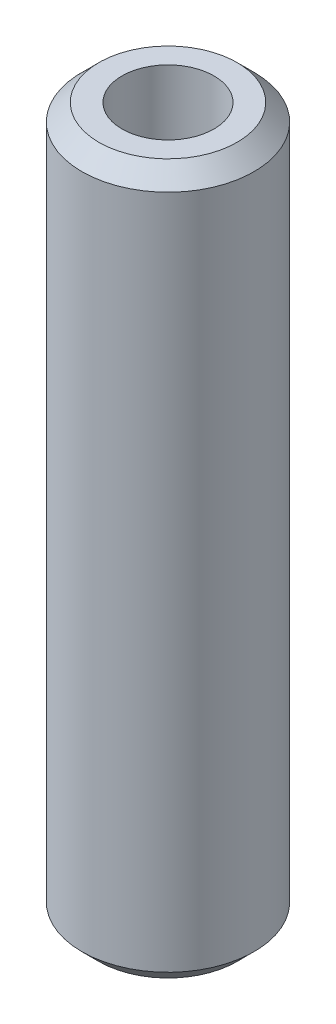
ISO-10303-21;
HEADER;
FILE_DESCRIPTION(('STEP AP214'),'2;1');
FILE_NAME('part.step','',(''),(''),'','','');
FILE_SCHEMA(('AUTOMOTIVE_DESIGN { 1 0 10303 214 1 1 1 1 }'));
ENDSEC;
DATA;
#1=APPLICATION_CONTEXT('core data for automotive mechanical design processes');
#2=APPLICATION_PROTOCOL_DEFINITION('international standard','automotive_design',2000,#1);
#3=PRODUCT_CONTEXT('',#1,'mechanical');
#4=PRODUCT('Part','Part','',(#3));
#5=PRODUCT_RELATED_PRODUCT_CATEGORY('part','',(#4));
#6=PRODUCT_DEFINITION_FORMATION('','',#4);
#7=PRODUCT_DEFINITION_CONTEXT('part definition',#1,'design');
#8=PRODUCT_DEFINITION('design','',#6,#7);
#9=PRODUCT_DEFINITION_SHAPE('','',#8);
#10=(LENGTH_UNIT() NAMED_UNIT(*) SI_UNIT(.MILLI.,.METRE.));
#11=(NAMED_UNIT(*) PLANE_ANGLE_UNIT() SI_UNIT($,.RADIAN.));
#12=(NAMED_UNIT(*) SI_UNIT($,.STERADIAN.) SOLID_ANGLE_UNIT());
#13=UNCERTAINTY_MEASURE_WITH_UNIT(LENGTH_MEASURE(1.E-05),#10,'distance_accuracy_value','');
#14=(GEOMETRIC_REPRESENTATION_CONTEXT(3) GLOBAL_UNCERTAINTY_ASSIGNED_CONTEXT((#13)) GLOBAL_UNIT_ASSIGNED_CONTEXT((#10,
#11,#12)) REPRESENTATION_CONTEXT('',''));
#15=CARTESIAN_POINT('',(0.,0.,0.));
#16=DIRECTION('',(0.,0.,1.));
#17=DIRECTION('',(1.,0.,0.));
#18=AXIS2_PLACEMENT_3D('',#15,#16,#17);
#19=CARTESIAN_POINT('',(0.,41.2162446537722,0.));
#20=DIRECTION('',(0.,-1.,0.));
#21=DIRECTION('',(0.,0.,-1.));
#22=AXIS2_PLACEMENT_3D('',#19,#20,#21);
#23=CYLINDRICAL_SURFACE('',#22,5.);
#24=CARTESIAN_POINT('',(0.,40.2321740518236,0.));
#25=DIRECTION('',(0.,1.,0.));
#26=DIRECTION('',(0.,0.,1.));
#27=AXIS2_PLACEMENT_3D('',#24,#25,#26);
#28=CIRCLE('',#27,5.);
#29=CARTESIAN_POINT('',(0.,40.2321740518236,5.));
#30=VERTEX_POINT('',#29);
#31=EDGE_CURVE('E50',#30,#30,#28,.F.);
#32=ORIENTED_EDGE('',*,*,#31,.T.);
#33=EDGE_LOOP('',(#32));
#34=FACE_BOUND('',#33,.T.);
#35=CARTESIAN_POINT('',(0.,0.984070601948564,0.));
#36=DIRECTION('',(0.,1.,0.));
#37=DIRECTION('',(0.,0.,1.));
#38=AXIS2_PLACEMENT_3D('',#35,#36,#37);
#39=CIRCLE('',#38,5.);
#40=CARTESIAN_POINT('',(0.,0.984070601948564,5.));
#41=VERTEX_POINT('',#40);
#42=EDGE_CURVE('E51',#41,#41,#39,.T.);
#43=ORIENTED_EDGE('',*,*,#42,.T.);
#44=EDGE_LOOP('',(#43));
#45=FACE_BOUND('',#44,.T.);
#46=ADVANCED_FACE('F39',(#34,#45),#23,.T.);
#47=CARTESIAN_POINT('',(0.,41.2162446537722,0.));
#48=DIRECTION('',(0.,1.,0.));
#49=DIRECTION('',(0.,0.,1.));
#50=AXIS2_PLACEMENT_3D('',#47,#48,#49);
#51=PLANE('',#50);
#52=CARTESIAN_POINT('',(0.,41.2162446537722,0.));
#53=DIRECTION('',(0.,1.,0.));
#54=DIRECTION('',(0.,0.,1.));
#55=AXIS2_PLACEMENT_3D('',#52,#53,#54);
#56=CIRCLE('',#55,4.01592939805143);
#57=CARTESIAN_POINT('',(0.,41.2162446537722,4.01592939805143));
#58=VERTEX_POINT('',#57);
#59=EDGE_CURVE('E54',#58,#58,#56,.T.);
#60=ORIENTED_EDGE('',*,*,#59,.T.);
#61=EDGE_LOOP('',(#60));
#62=FACE_BOUND('',#61,.T.);
#63=CARTESIAN_POINT('',(0.,41.2162446537722,0.));
#64=DIRECTION('',(0.,1.,0.));
#65=DIRECTION('',(0.,0.,1.));
#66=AXIS2_PLACEMENT_3D('',#63,#64,#65);
#67=CIRCLE('',#66,2.67355591880351);
#68=CARTESIAN_POINT('',(0.,41.2162446537722,2.67355591880351));
#69=VERTEX_POINT('',#68);
#70=EDGE_CURVE('E58',#69,#69,#67,.T.);
#71=ORIENTED_EDGE('',*,*,#70,.F.);
#72=EDGE_LOOP('',(#71));
#73=FACE_BOUND('',#72,.T.);
#74=ADVANCED_FACE('F69',(#62,#73),#51,.T.);
#75=CARTESIAN_POINT('',(0.,0.,0.));
#76=DIRECTION('',(0.,1.,0.));
#77=DIRECTION('',(0.,0.,1.));
#78=AXIS2_PLACEMENT_3D('',#75,#76,#77);
#79=PLANE('',#78);
#80=CARTESIAN_POINT('',(0.,0.,0.));
#81=DIRECTION('',(0.,1.,0.));
#82=DIRECTION('',(0.,0.,1.));
#83=AXIS2_PLACEMENT_3D('',#80,#81,#82);
#84=CIRCLE('',#83,4.01592939805143);
#85=CARTESIAN_POINT('',(0.,0.,4.01592939805143));
#86=VERTEX_POINT('',#85);
#87=EDGE_CURVE('E10',#86,#86,#84,.F.);
#88=ORIENTED_EDGE('',*,*,#87,.T.);
#89=EDGE_LOOP('',(#88));
#90=FACE_BOUND('',#89,.T.);
#91=CARTESIAN_POINT('',(0.,0.,0.));
#92=DIRECTION('',(0.,1.,0.));
#93=DIRECTION('',(0.,0.,1.));
#94=AXIS2_PLACEMENT_3D('',#91,#92,#93);
#95=CIRCLE('',#94,2.67355591880351);
#96=CARTESIAN_POINT('',(0.,0.,2.67355591880351));
#97=VERTEX_POINT('',#96);
#98=EDGE_CURVE('E63',#97,#97,#95,.T.);
#99=ORIENTED_EDGE('',*,*,#98,.T.);
#100=EDGE_LOOP('',(#99));
#101=FACE_BOUND('',#100,.T.);
#102=ADVANCED_FACE('F75',(#90,#101),#79,.F.);
#103=CARTESIAN_POINT('',(0.,41.2162446537722,0.));
#104=DIRECTION('',(0.,-1.,0.));
#105=DIRECTION('',(0.,0.,-1.));
#106=AXIS2_PLACEMENT_3D('',#103,#104,#105);
#107=CYLINDRICAL_SURFACE('',#106,2.67355591880351);
#108=ORIENTED_EDGE('',*,*,#70,.T.);
#109=EDGE_LOOP('',(#108));
#110=FACE_BOUND('',#109,.T.);
#111=ORIENTED_EDGE('',*,*,#98,.F.);
#112=EDGE_LOOP('',(#111));
#113=FACE_BOUND('',#112,.T.);
#114=ADVANCED_FACE('F70',(#110,#113),#107,.F.);
#115=CARTESIAN_POINT('',(0.,41.2162446537722,0.));
#116=DIRECTION('',(0.,-1.,0.));
#117=DIRECTION('',(0.,0.,-1.));
#118=AXIS2_PLACEMENT_3D('',#115,#116,#117);
#119=CONICAL_SURFACE('',#118,4.01592939805143,0.785398163397446);
#120=ORIENTED_EDGE('',*,*,#31,.F.);
#121=EDGE_LOOP('',(#120));
#122=FACE_BOUND('',#121,.T.);
#123=ORIENTED_EDGE('',*,*,#59,.F.);
#124=EDGE_LOOP('',(#123));
#125=FACE_BOUND('',#124,.T.);
#126=ADVANCED_FACE('F81',(#122,#125),#119,.T.);
#127=CARTESIAN_POINT('',(0.,0.984070601948564,0.));
#128=DIRECTION('',(0.,1.,0.));
#129=DIRECTION('',(0.,0.,1.));
#130=AXIS2_PLACEMENT_3D('',#127,#128,#129);
#131=CONICAL_SURFACE('',#130,5.,0.785398163397453);
#132=ORIENTED_EDGE('',*,*,#87,.F.);
#133=EDGE_LOOP('',(#132));
#134=FACE_BOUND('',#133,.T.);
#135=ORIENTED_EDGE('',*,*,#42,.F.);
#136=EDGE_LOOP('',(#135));
#137=FACE_BOUND('',#136,.T.);
#138=ADVANCED_FACE('F45',(#134,#137),#131,.T.);
#139=CLOSED_SHELL('',(#46,#74,#102,#114,#126,#138));
#140=MANIFOLD_SOLID_BREP('B2',#139);
#141=ADVANCED_BREP_SHAPE_REPRESENTATION('',(#18,#140),#14);
#142=SHAPE_DEFINITION_REPRESENTATION(#9,#141);
ENDSEC;
END-ISO-10303-21;
